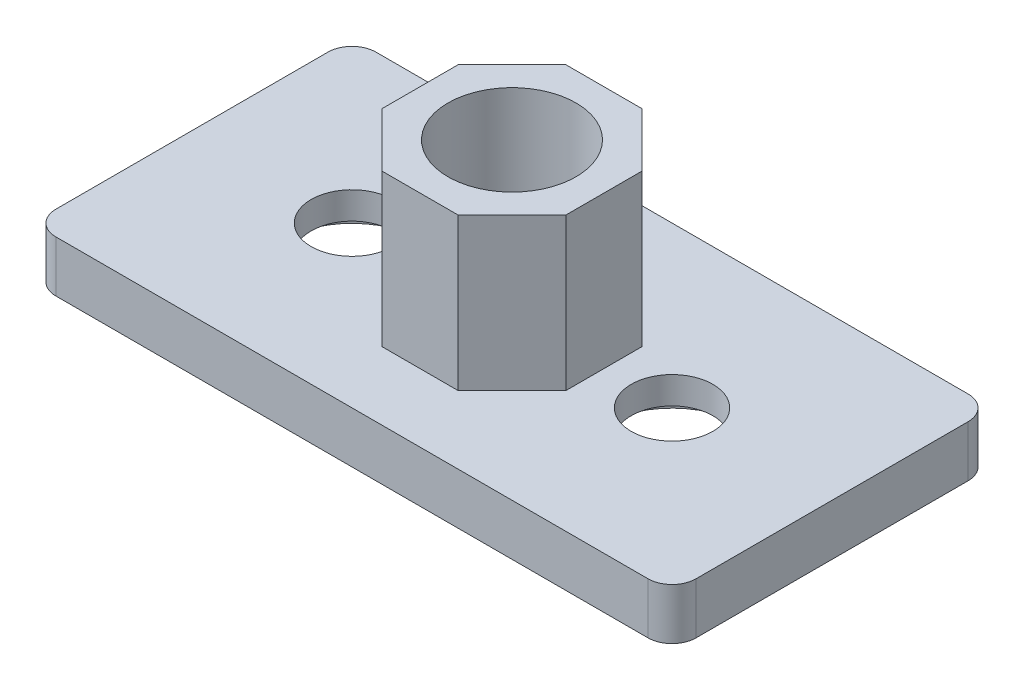
ISO-10303-21;
HEADER;
FILE_DESCRIPTION(('STEP AP214'),'2;1');
FILE_NAME('part.step','',(''),(''),'','','');
FILE_SCHEMA(('AUTOMOTIVE_DESIGN { 1 0 10303 214 1 1 1 1 }'));
ENDSEC;
DATA;
#1=APPLICATION_CONTEXT('core data for automotive mechanical design processes');
#2=APPLICATION_PROTOCOL_DEFINITION('international standard','automotive_design',2000,#1);
#3=PRODUCT_CONTEXT('',#1,'mechanical');
#4=PRODUCT('Part','Part','',(#3));
#5=PRODUCT_RELATED_PRODUCT_CATEGORY('part','',(#4));
#6=PRODUCT_DEFINITION_FORMATION('','',#4);
#7=PRODUCT_DEFINITION_CONTEXT('part definition',#1,'design');
#8=PRODUCT_DEFINITION('design','',#6,#7);
#9=PRODUCT_DEFINITION_SHAPE('','',#8);
#10=(LENGTH_UNIT() NAMED_UNIT(*) SI_UNIT(.MILLI.,.METRE.));
#11=(NAMED_UNIT(*) PLANE_ANGLE_UNIT() SI_UNIT($,.RADIAN.));
#12=(NAMED_UNIT(*) SI_UNIT($,.STERADIAN.) SOLID_ANGLE_UNIT());
#13=UNCERTAINTY_MEASURE_WITH_UNIT(LENGTH_MEASURE(1.E-05),#10,'distance_accuracy_value','');
#14=(GEOMETRIC_REPRESENTATION_CONTEXT(3) GLOBAL_UNCERTAINTY_ASSIGNED_CONTEXT((#13)) GLOBAL_UNIT_ASSIGNED_CONTEXT((#10,
#11,#12)) REPRESENTATION_CONTEXT('',''));
#15=CARTESIAN_POINT('',(0.,0.,0.));
#16=DIRECTION('',(0.,0.,1.));
#17=DIRECTION('',(1.,0.,0.));
#18=AXIS2_PLACEMENT_3D('',#15,#16,#17);
#19=CARTESIAN_POINT('',(20.,1.6,20.));
#20=DIRECTION('',(0.,-1.,0.));
#21=DIRECTION('',(1.,0.,0.));
#22=AXIS2_PLACEMENT_3D('',#19,#20,#21);
#23=PLANE('',#22);
#24=DIRECTION('',(0.,0.,-1.));
#25=VECTOR('',#24,1.);
#26=CARTESIAN_POINT('',(20.,1.6,20.));
#27=LINE('',#26,#25);
#28=CARTESIAN_POINT('',(20.,1.6,18.5));
#29=VERTEX_POINT('',#28);
#30=CARTESIAN_POINT('',(20.,1.6,1.5));
#31=VERTEX_POINT('',#30);
#32=EDGE_CURVE('E212',#29,#31,#27,.T.);
#33=ORIENTED_EDGE('',*,*,#32,.T.);
#34=CARTESIAN_POINT('',(18.5,1.6,1.5));
#35=DIRECTION('',(0.,-1.,0.));
#36=DIRECTION('',(1.,0.,0.));
#37=AXIS2_PLACEMENT_3D('',#34,#35,#36);
#38=CIRCLE('',#37,1.5);
#39=CARTESIAN_POINT('',(18.5,1.6,0.));
#40=VERTEX_POINT('',#39);
#41=EDGE_CURVE('E235',#31,#40,#38,.F.);
#42=ORIENTED_EDGE('',*,*,#41,.T.);
#43=DIRECTION('',(-1.,0.,0.));
#44=VECTOR('',#43,1.);
#45=CARTESIAN_POINT('',(20.,1.6,0.));
#46=LINE('',#45,#44);
#47=CARTESIAN_POINT('',(-18.5,1.6,0.));
#48=VERTEX_POINT('',#47);
#49=EDGE_CURVE('E202',#40,#48,#46,.T.);
#50=ORIENTED_EDGE('',*,*,#49,.T.);
#51=CARTESIAN_POINT('',(-18.5,1.6,1.5));
#52=DIRECTION('',(0.,-1.,0.));
#53=DIRECTION('',(1.,0.,0.));
#54=AXIS2_PLACEMENT_3D('',#51,#52,#53);
#55=CIRCLE('',#54,1.5);
#56=CARTESIAN_POINT('',(-20.,1.6,1.5));
#57=VERTEX_POINT('',#56);
#58=EDGE_CURVE('E231',#48,#57,#55,.F.);
#59=ORIENTED_EDGE('',*,*,#58,.T.);
#60=DIRECTION('',(0.,0.,-1.));
#61=VECTOR('',#60,1.);
#62=CARTESIAN_POINT('',(-20.,1.6,20.));
#63=LINE('',#62,#61);
#64=CARTESIAN_POINT('',(-20.,1.6,18.5));
#65=VERTEX_POINT('',#64);
#66=EDGE_CURVE('E205',#65,#57,#63,.T.);
#67=ORIENTED_EDGE('',*,*,#66,.F.);
#68=CARTESIAN_POINT('',(-18.5,1.6,18.5));
#69=DIRECTION('',(0.,-1.,0.));
#70=DIRECTION('',(1.,0.,0.));
#71=AXIS2_PLACEMENT_3D('',#68,#69,#70);
#72=CIRCLE('',#71,1.5);
#73=CARTESIAN_POINT('',(-18.5,1.6,20.));
#74=VERTEX_POINT('',#73);
#75=EDGE_CURVE('E229',#65,#74,#72,.F.);
#76=ORIENTED_EDGE('',*,*,#75,.T.);
#77=DIRECTION('',(-1.,0.,0.));
#78=VECTOR('',#77,1.);
#79=CARTESIAN_POINT('',(20.,1.6,20.));
#80=LINE('',#79,#78);
#81=CARTESIAN_POINT('',(18.5,1.6,20.));
#82=VERTEX_POINT('',#81);
#83=EDGE_CURVE('E201',#82,#74,#80,.T.);
#84=ORIENTED_EDGE('',*,*,#83,.F.);
#85=CARTESIAN_POINT('',(18.5,1.6,18.5));
#86=DIRECTION('',(0.,-1.,0.));
#87=DIRECTION('',(1.,0.,0.));
#88=AXIS2_PLACEMENT_3D('',#85,#86,#87);
#89=CIRCLE('',#88,1.5);
#90=EDGE_CURVE('E233',#82,#29,#89,.F.);
#91=ORIENTED_EDGE('',*,*,#90,.T.);
#92=EDGE_LOOP('',(#33,#42,#50,#59,#67,#76,#84,#91));
#93=FACE_BOUND('',#92,.T.);
#94=CARTESIAN_POINT('',(-10.,1.6,10.));
#95=DIRECTION('',(0.,1.,0.));
#96=DIRECTION('',(-1.,0.,0.));
#97=AXIS2_PLACEMENT_3D('',#94,#95,#96);
#98=CIRCLE('',#97,2.55);
#99=CARTESIAN_POINT('',(-12.55,1.6,10.));
#100=VERTEX_POINT('',#99);
#101=EDGE_CURVE('E194',#100,#100,#98,.T.);
#102=ORIENTED_EDGE('',*,*,#101,.F.);
#103=EDGE_LOOP('',(#102));
#104=FACE_BOUND('',#103,.T.);
#105=CARTESIAN_POINT('',(10.,1.6,10.));
#106=DIRECTION('',(0.,1.,0.));
#107=DIRECTION('',(1.,0.,0.));
#108=AXIS2_PLACEMENT_3D('',#105,#106,#107);
#109=CIRCLE('',#108,2.55);
#110=CARTESIAN_POINT('',(12.55,1.6,10.));
#111=VERTEX_POINT('',#110);
#112=EDGE_CURVE('E191',#111,#111,#109,.T.);
#113=ORIENTED_EDGE('',*,*,#112,.F.);
#114=EDGE_LOOP('',(#113));
#115=FACE_BOUND('',#114,.T.);
#116=DIRECTION('',(-1.,0.,0.));
#117=VECTOR('',#116,1.);
#118=CARTESIAN_POINT('',(2.3817279836453,1.6,4.25));
#119=LINE('',#118,#117);
#120=CARTESIAN_POINT('',(2.3817279836453,1.6,4.25));
#121=VERTEX_POINT('',#120);
#122=CARTESIAN_POINT('',(-2.3817279836453,1.6,4.25));
#123=VERTEX_POINT('',#122);
#124=EDGE_CURVE('E171',#121,#123,#119,.T.);
#125=ORIENTED_EDGE('',*,*,#124,.F.);
#126=DIRECTION('',(-0.707106781186548,0.,-0.707106781186547));
#127=VECTOR('',#126,1.);
#128=CARTESIAN_POINT('',(5.75,1.6,7.61827201635471));
#129=LINE('',#128,#127);
#130=CARTESIAN_POINT('',(5.75,1.6,7.6182720163547));
#131=VERTEX_POINT('',#130);
#132=EDGE_CURVE('E168',#131,#121,#129,.T.);
#133=ORIENTED_EDGE('',*,*,#132,.F.);
#134=DIRECTION('',(0.,0.,-1.));
#135=VECTOR('',#134,1.);
#136=CARTESIAN_POINT('',(5.75,1.6,12.3817279836453));
#137=LINE('',#136,#135);
#138=CARTESIAN_POINT('',(5.75,1.6,12.3817279836453));
#139=VERTEX_POINT('',#138);
#140=EDGE_CURVE('E536',#139,#131,#137,.T.);
#141=ORIENTED_EDGE('',*,*,#140,.F.);
#142=DIRECTION('',(0.707106781186547,0.,-0.707106781186548));
#143=VECTOR('',#142,1.);
#144=CARTESIAN_POINT('',(2.3817279836453,1.6,15.75));
#145=LINE('',#144,#143);
#146=CARTESIAN_POINT('',(2.38172798364531,1.6,15.75));
#147=VERTEX_POINT('',#146);
#148=EDGE_CURVE('E568',#147,#139,#145,.T.);
#149=ORIENTED_EDGE('',*,*,#148,.F.);
#150=DIRECTION('',(1.,0.,0.));
#151=VECTOR('',#150,1.);
#152=CARTESIAN_POINT('',(-2.38172798364529,1.6,15.75));
#153=LINE('',#152,#151);
#154=CARTESIAN_POINT('',(-2.38172798364529,1.6,15.75));
#155=VERTEX_POINT('',#154);
#156=EDGE_CURVE('E562',#155,#147,#153,.T.);
#157=ORIENTED_EDGE('',*,*,#156,.F.);
#158=DIRECTION('',(0.707106781186548,0.,0.707106781186547));
#159=VECTOR('',#158,1.);
#160=CARTESIAN_POINT('',(-5.75,1.6,12.3817279836453));
#161=LINE('',#160,#159);
#162=CARTESIAN_POINT('',(-5.74999999999999,1.6,12.3817279836453));
#163=VERTEX_POINT('',#162);
#164=EDGE_CURVE('E557',#163,#155,#161,.T.);
#165=ORIENTED_EDGE('',*,*,#164,.F.);
#166=DIRECTION('',(0.,0.,1.));
#167=VECTOR('',#166,1.);
#168=CARTESIAN_POINT('',(-5.75,1.6,7.61827201635471));
#169=LINE('',#168,#167);
#170=CARTESIAN_POINT('',(-5.75,1.6,7.61827201635471));
#171=VERTEX_POINT('',#170);
#172=EDGE_CURVE('E560',#171,#163,#169,.T.);
#173=ORIENTED_EDGE('',*,*,#172,.F.);
#174=DIRECTION('',(-0.707106781186547,0.,0.707106781186548));
#175=VECTOR('',#174,1.);
#176=CARTESIAN_POINT('',(-2.38172798364529,1.6,4.25));
#177=LINE('',#176,#175);
#178=EDGE_CURVE('E529',#123,#171,#177,.T.);
#179=ORIENTED_EDGE('',*,*,#178,.F.);
#180=EDGE_LOOP('',(#125,#133,#141,#149,#157,#165,#173,#179));
#181=FACE_BOUND('',#180,.T.);
#182=ADVANCED_FACE('F33',(#93,#104,#115,#181),#23,.F.);
#183=CARTESIAN_POINT('',(-10.,-1.60000000000001,10.));
#184=DIRECTION('',(0.,1.,0.));
#185=DIRECTION('',(-1.,0.,0.));
#186=AXIS2_PLACEMENT_3D('',#183,#184,#185);
#187=CYLINDRICAL_SURFACE('',#186,2.55);
#188=ORIENTED_EDGE('',*,*,#101,.T.);
#189=EDGE_LOOP('',(#188));
#190=FACE_BOUND('',#189,.T.);
#191=CARTESIAN_POINT('',(-10.,-0.100000000000002,10.));
#192=DIRECTION('',(0.,-1.,0.));
#193=DIRECTION('',(1.,0.,0.));
#194=AXIS2_PLACEMENT_3D('',#191,#192,#193);
#195=CIRCLE('',#194,2.55);
#196=CARTESIAN_POINT('',(-7.45,-0.100000000000001,10.));
#197=VERTEX_POINT('',#196);
#198=EDGE_CURVE('E182',#197,#197,#195,.F.);
#199=ORIENTED_EDGE('',*,*,#198,.F.);
#200=EDGE_LOOP('',(#199));
#201=FACE_BOUND('',#200,.T.);
#202=ADVANCED_FACE('F292',(#190,#201),#187,.F.);
#203=CARTESIAN_POINT('',(10.,-1.6,10.));
#204=DIRECTION('',(0.,1.,0.));
#205=DIRECTION('',(-1.,0.,0.));
#206=AXIS2_PLACEMENT_3D('',#203,#204,#205);
#207=CYLINDRICAL_SURFACE('',#206,2.55);
#208=ORIENTED_EDGE('',*,*,#112,.T.);
#209=EDGE_LOOP('',(#208));
#210=FACE_BOUND('',#209,.T.);
#211=CARTESIAN_POINT('',(10.,-0.0999999999999987,10.));
#212=DIRECTION('',(0.,-1.,0.));
#213=DIRECTION('',(1.,0.,0.));
#214=AXIS2_PLACEMENT_3D('',#211,#212,#213);
#215=CIRCLE('',#214,2.55);
#216=CARTESIAN_POINT('',(12.55,-0.0999999999999984,10.));
#217=VERTEX_POINT('',#216);
#218=EDGE_CURVE('E187',#217,#217,#215,.F.);
#219=ORIENTED_EDGE('',*,*,#218,.F.);
#220=EDGE_LOOP('',(#219));
#221=FACE_BOUND('',#220,.T.);
#222=ADVANCED_FACE('F297',(#210,#221),#207,.F.);
#223=CARTESIAN_POINT('',(-20.,-1.6,20.));
#224=DIRECTION('',(1.,0.,0.));
#225=DIRECTION('',(0.,0.,-1.));
#226=AXIS2_PLACEMENT_3D('',#223,#224,#225);
#227=PLANE('',#226);
#228=ORIENTED_EDGE('',*,*,#66,.T.);
#229=DIRECTION('',(0.,-1.,0.));
#230=VECTOR('',#229,1.);
#231=CARTESIAN_POINT('',(-20.,-1.6,1.5));
#232=LINE('',#231,#230);
#233=CARTESIAN_POINT('',(-20.,-1.6,1.5));
#234=VERTEX_POINT('',#233);
#235=EDGE_CURVE('E11',#57,#234,#232,.T.);
#236=ORIENTED_EDGE('',*,*,#235,.T.);
#237=DIRECTION('',(0.,0.,-1.));
#238=VECTOR('',#237,1.);
#239=CARTESIAN_POINT('',(-20.,-1.6,20.));
#240=LINE('',#239,#238);
#241=CARTESIAN_POINT('',(-20.,-1.6,18.5));
#242=VERTEX_POINT('',#241);
#243=EDGE_CURVE('E218',#242,#234,#240,.T.);
#244=ORIENTED_EDGE('',*,*,#243,.F.);
#245=DIRECTION('',(0.,-1.,0.));
#246=VECTOR('',#245,1.);
#247=CARTESIAN_POINT('',(-20.,1.6,18.5));
#248=LINE('',#247,#246);
#249=EDGE_CURVE('E41',#242,#65,#248,.F.);
#250=ORIENTED_EDGE('',*,*,#249,.T.);
#251=EDGE_LOOP('',(#228,#236,#244,#250));
#252=FACE_BOUND('',#251,.T.);
#253=ADVANCED_FACE('F255',(#252),#227,.F.);
#254=CARTESIAN_POINT('',(20.,-1.6,20.));
#255=DIRECTION('',(0.,1.,0.));
#256=DIRECTION('',(-1.,0.,0.));
#257=AXIS2_PLACEMENT_3D('',#254,#255,#256);
#258=PLANE('',#257);
#259=CARTESIAN_POINT('',(0.,-1.6,10.));
#260=DIRECTION('',(0.,1.,0.));
#261=DIRECTION('',(-1.,0.,0.));
#262=AXIS2_PLACEMENT_3D('',#259,#260,#261);
#263=CIRCLE('',#262,4.);
#264=CARTESIAN_POINT('',(-4.,-1.6,10.));
#265=VERTEX_POINT('',#264);
#266=EDGE_CURVE('E530',#265,#265,#263,.T.);
#267=ORIENTED_EDGE('',*,*,#266,.T.);
#268=EDGE_LOOP('',(#267));
#269=FACE_BOUND('',#268,.T.);
#270=CARTESIAN_POINT('',(-10.,-1.6,10.));
#271=DIRECTION('',(0.,-1.,0.));
#272=DIRECTION('',(1.,0.,0.));
#273=AXIS2_PLACEMENT_3D('',#270,#271,#272);
#274=CIRCLE('',#273,4.5);
#275=CARTESIAN_POINT('',(-5.5,-1.6,10.));
#276=VERTEX_POINT('',#275);
#277=EDGE_CURVE('E172',#276,#276,#274,.T.);
#278=ORIENTED_EDGE('',*,*,#277,.F.);
#279=EDGE_LOOP('',(#278));
#280=FACE_BOUND('',#279,.T.);
#281=CARTESIAN_POINT('',(10.,-1.6,10.));
#282=DIRECTION('',(0.,-1.,0.));
#283=DIRECTION('',(1.,0.,0.));
#284=AXIS2_PLACEMENT_3D('',#281,#282,#283);
#285=CIRCLE('',#284,4.5);
#286=CARTESIAN_POINT('',(14.5,-1.6,10.));
#287=VERTEX_POINT('',#286);
#288=EDGE_CURVE('E188',#287,#287,#285,.T.);
#289=ORIENTED_EDGE('',*,*,#288,.F.);
#290=EDGE_LOOP('',(#289));
#291=FACE_BOUND('',#290,.T.);
#292=DIRECTION('',(1.,0.,0.));
#293=VECTOR('',#292,1.);
#294=CARTESIAN_POINT('',(20.,-1.6,0.));
#295=LINE('',#294,#293);
#296=CARTESIAN_POINT('',(-18.5,-1.6,0.));
#297=VERTEX_POINT('',#296);
#298=CARTESIAN_POINT('',(18.5,-1.6,0.));
#299=VERTEX_POINT('',#298);
#300=EDGE_CURVE('E197',#297,#299,#295,.T.);
#301=ORIENTED_EDGE('',*,*,#300,.T.);
#302=CARTESIAN_POINT('',(18.5,-1.6,1.5));
#303=DIRECTION('',(0.,1.,0.));
#304=DIRECTION('',(-1.,0.,0.));
#305=AXIS2_PLACEMENT_3D('',#302,#303,#304);
#306=CIRCLE('',#305,1.5);
#307=CARTESIAN_POINT('',(20.,-1.6,1.5));
#308=VERTEX_POINT('',#307);
#309=EDGE_CURVE('E245',#299,#308,#306,.F.);
#310=ORIENTED_EDGE('',*,*,#309,.T.);
#311=DIRECTION('',(0.,0.,-1.));
#312=VECTOR('',#311,1.);
#313=CARTESIAN_POINT('',(20.,-1.6,20.));
#314=LINE('',#313,#312);
#315=CARTESIAN_POINT('',(20.,-1.6,18.5));
#316=VERTEX_POINT('',#315);
#317=EDGE_CURVE('E215',#316,#308,#314,.T.);
#318=ORIENTED_EDGE('',*,*,#317,.F.);
#319=CARTESIAN_POINT('',(18.5,-1.6,18.5));
#320=DIRECTION('',(0.,1.,0.));
#321=DIRECTION('',(-1.,0.,0.));
#322=AXIS2_PLACEMENT_3D('',#319,#320,#321);
#323=CIRCLE('',#322,1.5);
#324=CARTESIAN_POINT('',(18.5,-1.6,20.));
#325=VERTEX_POINT('',#324);
#326=EDGE_CURVE('E243',#316,#325,#323,.F.);
#327=ORIENTED_EDGE('',*,*,#326,.T.);
#328=DIRECTION('',(1.,0.,0.));
#329=VECTOR('',#328,1.);
#330=CARTESIAN_POINT('',(20.,-1.6,20.));
#331=LINE('',#330,#329);
#332=CARTESIAN_POINT('',(-18.5,-1.6,20.));
#333=VERTEX_POINT('',#332);
#334=EDGE_CURVE('E198',#333,#325,#331,.T.);
#335=ORIENTED_EDGE('',*,*,#334,.F.);
#336=CARTESIAN_POINT('',(-18.5,-1.6,18.5));
#337=DIRECTION('',(0.,1.,0.));
#338=DIRECTION('',(-1.,0.,0.));
#339=AXIS2_PLACEMENT_3D('',#336,#337,#338);
#340=CIRCLE('',#339,1.5);
#341=EDGE_CURVE('E55',#333,#242,#340,.F.);
#342=ORIENTED_EDGE('',*,*,#341,.T.);
#343=ORIENTED_EDGE('',*,*,#243,.T.);
#344=CARTESIAN_POINT('',(-18.5,-1.6,1.5));
#345=DIRECTION('',(0.,1.,0.));
#346=DIRECTION('',(-1.,0.,0.));
#347=AXIS2_PLACEMENT_3D('',#344,#345,#346);
#348=CIRCLE('',#347,1.5);
#349=EDGE_CURVE('E48',#234,#297,#348,.F.);
#350=ORIENTED_EDGE('',*,*,#349,.T.);
#351=EDGE_LOOP('',(#301,#310,#318,#327,#335,#342,#343,#350));
#352=FACE_BOUND('',#351,.T.);
#353=ADVANCED_FACE('F266',(#269,#280,#291,#352),#258,.F.);
#354=CARTESIAN_POINT('',(20.,-1.6,20.));
#355=DIRECTION('',(-1.,0.,0.));
#356=DIRECTION('',(0.,0.,1.));
#357=AXIS2_PLACEMENT_3D('',#354,#355,#356);
#358=PLANE('',#357);
#359=ORIENTED_EDGE('',*,*,#317,.T.);
#360=DIRECTION('',(0.,1.,0.));
#361=VECTOR('',#360,1.);
#362=CARTESIAN_POINT('',(20.,-1.6,1.5));
#363=LINE('',#362,#361);
#364=EDGE_CURVE('E226',#308,#31,#363,.T.);
#365=ORIENTED_EDGE('',*,*,#364,.T.);
#366=ORIENTED_EDGE('',*,*,#32,.F.);
#367=DIRECTION('',(0.,1.,0.));
#368=VECTOR('',#367,1.);
#369=CARTESIAN_POINT('',(20.,-1.6,18.5));
#370=LINE('',#369,#368);
#371=EDGE_CURVE('E220',#29,#316,#370,.F.);
#372=ORIENTED_EDGE('',*,*,#371,.T.);
#373=EDGE_LOOP('',(#359,#365,#366,#372));
#374=FACE_BOUND('',#373,.T.);
#375=ADVANCED_FACE('F274',(#374),#358,.F.);
#376=CARTESIAN_POINT('',(0.,0.,20.));
#377=DIRECTION('',(0.,0.,1.));
#378=DIRECTION('',(1.,0.,0.));
#379=AXIS2_PLACEMENT_3D('',#376,#377,#378);
#380=PLANE('',#379);
#381=ORIENTED_EDGE('',*,*,#334,.T.);
#382=DIRECTION('',(0.,1.,0.));
#383=VECTOR('',#382,1.);
#384=CARTESIAN_POINT('',(18.5,1.6,20.));
#385=LINE('',#384,#383);
#386=EDGE_CURVE('E250',#325,#82,#385,.T.);
#387=ORIENTED_EDGE('',*,*,#386,.T.);
#388=ORIENTED_EDGE('',*,*,#83,.T.);
#389=DIRECTION('',(0.,-1.,0.));
#390=VECTOR('',#389,1.);
#391=CARTESIAN_POINT('',(-18.5,-1.6,20.));
#392=LINE('',#391,#390);
#393=EDGE_CURVE('E247',#74,#333,#392,.T.);
#394=ORIENTED_EDGE('',*,*,#393,.T.);
#395=EDGE_LOOP('',(#381,#387,#388,#394));
#396=FACE_BOUND('',#395,.T.);
#397=ADVANCED_FACE('F264',(#396),#380,.T.);
#398=CARTESIAN_POINT('',(0.,0.,0.));
#399=DIRECTION('',(0.,0.,1.));
#400=DIRECTION('',(1.,0.,0.));
#401=AXIS2_PLACEMENT_3D('',#398,#399,#400);
#402=PLANE('',#401);
#403=ORIENTED_EDGE('',*,*,#49,.F.);
#404=DIRECTION('',(0.,1.,0.));
#405=VECTOR('',#404,1.);
#406=CARTESIAN_POINT('',(18.5,0.,0.));
#407=LINE('',#406,#405);
#408=EDGE_CURVE('E239',#40,#299,#407,.F.);
#409=ORIENTED_EDGE('',*,*,#408,.T.);
#410=ORIENTED_EDGE('',*,*,#300,.F.);
#411=DIRECTION('',(0.,-1.,0.));
#412=VECTOR('',#411,1.);
#413=CARTESIAN_POINT('',(-18.5,0.,0.));
#414=LINE('',#413,#412);
#415=EDGE_CURVE('E237',#297,#48,#414,.F.);
#416=ORIENTED_EDGE('',*,*,#415,.T.);
#417=EDGE_LOOP('',(#403,#409,#410,#416));
#418=FACE_BOUND('',#417,.T.);
#419=ADVANCED_FACE('F282',(#418),#402,.F.);
#420=CARTESIAN_POINT('',(10.,-0.0999999999999987,10.));
#421=DIRECTION('',(0.,-1.,0.));
#422=DIRECTION('',(1.,0.,0.));
#423=AXIS2_PLACEMENT_3D('',#420,#421,#422);
#424=PLANE('',#423);
#425=CARTESIAN_POINT('',(10.,-0.0999999999999987,10.));
#426=DIRECTION('',(0.,-1.,0.));
#427=DIRECTION('',(1.,0.,0.));
#428=AXIS2_PLACEMENT_3D('',#425,#426,#427);
#429=CIRCLE('',#428,4.5);
#430=CARTESIAN_POINT('',(14.5,-0.099999999999998,10.));
#431=VERTEX_POINT('',#430);
#432=EDGE_CURVE('E184',#431,#431,#429,.T.);
#433=ORIENTED_EDGE('',*,*,#432,.T.);
#434=EDGE_LOOP('',(#433));
#435=FACE_BOUND('',#434,.T.);
#436=ORIENTED_EDGE('',*,*,#218,.T.);
#437=EDGE_LOOP('',(#436));
#438=FACE_BOUND('',#437,.T.);
#439=ADVANCED_FACE('F362',(#435,#438),#424,.T.);
#440=CARTESIAN_POINT('',(10.,-0.0999999999999987,10.));
#441=DIRECTION('',(0.,-1.,0.));
#442=DIRECTION('',(1.,0.,0.));
#443=AXIS2_PLACEMENT_3D('',#440,#441,#442);
#444=CYLINDRICAL_SURFACE('',#443,4.5);
#445=ORIENTED_EDGE('',*,*,#432,.F.);
#446=EDGE_LOOP('',(#445));
#447=FACE_BOUND('',#446,.T.);
#448=ORIENTED_EDGE('',*,*,#288,.T.);
#449=EDGE_LOOP('',(#448));
#450=FACE_BOUND('',#449,.T.);
#451=ADVANCED_FACE('F357',(#447,#450),#444,.F.);
#452=CARTESIAN_POINT('',(-10.,-0.100000000000002,10.));
#453=DIRECTION('',(0.,-1.,0.));
#454=DIRECTION('',(1.,0.,0.));
#455=AXIS2_PLACEMENT_3D('',#452,#453,#454);
#456=PLANE('',#455);
#457=CARTESIAN_POINT('',(-10.,-0.100000000000002,10.));
#458=DIRECTION('',(0.,-1.,0.));
#459=DIRECTION('',(1.,0.,0.));
#460=AXIS2_PLACEMENT_3D('',#457,#458,#459);
#461=CIRCLE('',#460,4.5);
#462=CARTESIAN_POINT('',(-5.5,-0.100000000000001,10.));
#463=VERTEX_POINT('',#462);
#464=EDGE_CURVE('E175',#463,#463,#461,.T.);
#465=ORIENTED_EDGE('',*,*,#464,.T.);
#466=EDGE_LOOP('',(#465));
#467=FACE_BOUND('',#466,.T.);
#468=ORIENTED_EDGE('',*,*,#198,.T.);
#469=EDGE_LOOP('',(#468));
#470=FACE_BOUND('',#469,.T.);
#471=ADVANCED_FACE('F354',(#467,#470),#456,.T.);
#472=CARTESIAN_POINT('',(-10.,-0.100000000000002,10.));
#473=DIRECTION('',(0.,-1.,0.));
#474=DIRECTION('',(1.,0.,0.));
#475=AXIS2_PLACEMENT_3D('',#472,#473,#474);
#476=CYLINDRICAL_SURFACE('',#475,4.5);
#477=ORIENTED_EDGE('',*,*,#464,.F.);
#478=EDGE_LOOP('',(#477));
#479=FACE_BOUND('',#478,.T.);
#480=ORIENTED_EDGE('',*,*,#277,.T.);
#481=EDGE_LOOP('',(#480));
#482=FACE_BOUND('',#481,.T.);
#483=ADVANCED_FACE('F353',(#479,#482),#476,.F.);
#484=CARTESIAN_POINT('',(2.3817279836453,11.1,4.25));
#485=DIRECTION('',(0.,0.,1.));
#486=DIRECTION('',(1.,0.,0.));
#487=AXIS2_PLACEMENT_3D('',#484,#485,#486);
#488=PLANE('',#487);
#489=ORIENTED_EDGE('',*,*,#124,.T.);
#490=DIRECTION('',(0.,-1.,0.));
#491=VECTOR('',#490,1.);
#492=CARTESIAN_POINT('',(-2.3817279836453,11.1,4.25));
#493=LINE('',#492,#491);
#494=CARTESIAN_POINT('',(-2.3817279836453,11.1,4.25));
#495=VERTEX_POINT('',#494);
#496=EDGE_CURVE('E152',#495,#123,#493,.T.);
#497=ORIENTED_EDGE('',*,*,#496,.F.);
#498=DIRECTION('',(-1.,0.,0.));
#499=VECTOR('',#498,1.);
#500=CARTESIAN_POINT('',(2.3817279836453,11.1,4.25));
#501=LINE('',#500,#499);
#502=CARTESIAN_POINT('',(2.3817279836453,11.1,4.25));
#503=VERTEX_POINT('',#502);
#504=EDGE_CURVE('E159',#503,#495,#501,.T.);
#505=ORIENTED_EDGE('',*,*,#504,.F.);
#506=DIRECTION('',(0.,-1.,0.));
#507=VECTOR('',#506,1.);
#508=CARTESIAN_POINT('',(2.3817279836453,11.1,4.25));
#509=LINE('',#508,#507);
#510=EDGE_CURVE('E533',#503,#121,#509,.T.);
#511=ORIENTED_EDGE('',*,*,#510,.T.);
#512=EDGE_LOOP('',(#489,#497,#505,#511));
#513=FACE_BOUND('',#512,.T.);
#514=ADVANCED_FACE('F170',(#513),#488,.F.);
#515=CARTESIAN_POINT('',(-2.3817279836453,11.1,4.25));
#516=DIRECTION('',(0.707106781186548,0.,0.707106781186547));
#517=DIRECTION('',(0.707106781186547,0.,-0.707106781186548));
#518=AXIS2_PLACEMENT_3D('',#515,#516,#517);
#519=PLANE('',#518);
#520=ORIENTED_EDGE('',*,*,#178,.T.);
#521=DIRECTION('',(0.,-1.,0.));
#522=VECTOR('',#521,1.);
#523=CARTESIAN_POINT('',(-5.75,11.1,7.61827201635471));
#524=LINE('',#523,#522);
#525=CARTESIAN_POINT('',(-5.75,11.1,7.61827201635471));
#526=VERTEX_POINT('',#525);
#527=EDGE_CURVE('E155',#526,#171,#524,.T.);
#528=ORIENTED_EDGE('',*,*,#527,.F.);
#529=DIRECTION('',(-0.707106781186547,0.,0.707106781186548));
#530=VECTOR('',#529,1.);
#531=CARTESIAN_POINT('',(-2.3817279836453,11.1,4.25));
#532=LINE('',#531,#530);
#533=EDGE_CURVE('E147',#495,#526,#532,.T.);
#534=ORIENTED_EDGE('',*,*,#533,.F.);
#535=ORIENTED_EDGE('',*,*,#496,.T.);
#536=EDGE_LOOP('',(#520,#528,#534,#535));
#537=FACE_BOUND('',#536,.T.);
#538=ADVANCED_FACE('F150',(#537),#519,.F.);
#539=CARTESIAN_POINT('',(-5.75,11.1,7.61827201635471));
#540=DIRECTION('',(1.,0.,0.));
#541=DIRECTION('',(0.,0.,-1.));
#542=AXIS2_PLACEMENT_3D('',#539,#540,#541);
#543=PLANE('',#542);
#544=ORIENTED_EDGE('',*,*,#172,.T.);
#545=DIRECTION('',(0.,-1.,0.));
#546=VECTOR('',#545,1.);
#547=CARTESIAN_POINT('',(-5.75,11.1,12.3817279836453));
#548=LINE('',#547,#546);
#549=CARTESIAN_POINT('',(-5.75,11.1,12.3817279836453));
#550=VERTEX_POINT('',#549);
#551=EDGE_CURVE('E177',#550,#163,#548,.T.);
#552=ORIENTED_EDGE('',*,*,#551,.F.);
#553=DIRECTION('',(0.,0.,1.));
#554=VECTOR('',#553,1.);
#555=CARTESIAN_POINT('',(-5.75,11.1,7.61827201635471));
#556=LINE('',#555,#554);
#557=EDGE_CURVE('E158',#526,#550,#556,.T.);
#558=ORIENTED_EDGE('',*,*,#557,.F.);
#559=ORIENTED_EDGE('',*,*,#527,.T.);
#560=EDGE_LOOP('',(#544,#552,#558,#559));
#561=FACE_BOUND('',#560,.T.);
#562=ADVANCED_FACE('F344',(#561),#543,.F.);
#563=CARTESIAN_POINT('',(-5.75,11.1,12.3817279836453));
#564=DIRECTION('',(0.707106781186547,0.,-0.707106781186548));
#565=DIRECTION('',(-0.707106781186548,0.,-0.707106781186547));
#566=AXIS2_PLACEMENT_3D('',#563,#564,#565);
#567=PLANE('',#566);
#568=ORIENTED_EDGE('',*,*,#164,.T.);
#569=DIRECTION('',(0.,-1.,0.));
#570=VECTOR('',#569,1.);
#571=CARTESIAN_POINT('',(-2.38172798364529,11.1,15.75));
#572=LINE('',#571,#570);
#573=CARTESIAN_POINT('',(-2.38172798364529,11.1,15.75));
#574=VERTEX_POINT('',#573);
#575=EDGE_CURVE('E550',#574,#155,#572,.T.);
#576=ORIENTED_EDGE('',*,*,#575,.F.);
#577=DIRECTION('',(0.707106781186548,0.,0.707106781186547));
#578=VECTOR('',#577,1.);
#579=CARTESIAN_POINT('',(-5.75,11.1,12.3817279836453));
#580=LINE('',#579,#578);
#581=EDGE_CURVE('E558',#550,#574,#580,.T.);
#582=ORIENTED_EDGE('',*,*,#581,.F.);
#583=ORIENTED_EDGE('',*,*,#551,.T.);
#584=EDGE_LOOP('',(#568,#576,#582,#583));
#585=FACE_BOUND('',#584,.T.);
#586=ADVANCED_FACE('F340',(#585),#567,.F.);
#587=CARTESIAN_POINT('',(-2.38172798364529,11.1,15.75));
#588=DIRECTION('',(0.,0.,-1.));
#589=DIRECTION('',(-1.,0.,0.));
#590=AXIS2_PLACEMENT_3D('',#587,#588,#589);
#591=PLANE('',#590);
#592=ORIENTED_EDGE('',*,*,#156,.T.);
#593=DIRECTION('',(0.,-1.,0.));
#594=VECTOR('',#593,1.);
#595=CARTESIAN_POINT('',(2.3817279836453,11.1,15.75));
#596=LINE('',#595,#594);
#597=CARTESIAN_POINT('',(2.3817279836453,11.1,15.75));
#598=VERTEX_POINT('',#597);
#599=EDGE_CURVE('E547',#598,#147,#596,.T.);
#600=ORIENTED_EDGE('',*,*,#599,.F.);
#601=DIRECTION('',(1.,0.,0.));
#602=VECTOR('',#601,1.);
#603=CARTESIAN_POINT('',(-2.38172798364529,11.1,15.75));
#604=LINE('',#603,#602);
#605=EDGE_CURVE('E576',#574,#598,#604,.T.);
#606=ORIENTED_EDGE('',*,*,#605,.F.);
#607=ORIENTED_EDGE('',*,*,#575,.T.);
#608=EDGE_LOOP('',(#592,#600,#606,#607));
#609=FACE_BOUND('',#608,.T.);
#610=ADVANCED_FACE('F336',(#609),#591,.F.);
#611=CARTESIAN_POINT('',(2.3817279836453,11.1,15.75));
#612=DIRECTION('',(-0.707106781186548,0.,-0.707106781186547));
#613=DIRECTION('',(-0.707106781186547,0.,0.707106781186548));
#614=AXIS2_PLACEMENT_3D('',#611,#612,#613);
#615=PLANE('',#614);
#616=ORIENTED_EDGE('',*,*,#148,.T.);
#617=DIRECTION('',(0.,-1.,0.));
#618=VECTOR('',#617,1.);
#619=CARTESIAN_POINT('',(5.75,11.1,12.3817279836453));
#620=LINE('',#619,#618);
#621=CARTESIAN_POINT('',(5.75,11.1,12.3817279836453));
#622=VERTEX_POINT('',#621);
#623=EDGE_CURVE('E539',#622,#139,#620,.T.);
#624=ORIENTED_EDGE('',*,*,#623,.F.);
#625=DIRECTION('',(0.707106781186547,0.,-0.707106781186548));
#626=VECTOR('',#625,1.);
#627=CARTESIAN_POINT('',(2.3817279836453,11.1,15.75));
#628=LINE('',#627,#626);
#629=EDGE_CURVE('E574',#598,#622,#628,.T.);
#630=ORIENTED_EDGE('',*,*,#629,.F.);
#631=ORIENTED_EDGE('',*,*,#599,.T.);
#632=EDGE_LOOP('',(#616,#624,#630,#631));
#633=FACE_BOUND('',#632,.T.);
#634=ADVANCED_FACE('F332',(#633),#615,.F.);
#635=CARTESIAN_POINT('',(5.75,11.1,12.3817279836453));
#636=DIRECTION('',(-1.,0.,0.));
#637=DIRECTION('',(0.,0.,1.));
#638=AXIS2_PLACEMENT_3D('',#635,#636,#637);
#639=PLANE('',#638);
#640=ORIENTED_EDGE('',*,*,#140,.T.);
#641=DIRECTION('',(0.,-1.,0.));
#642=VECTOR('',#641,1.);
#643=CARTESIAN_POINT('',(5.75,11.1,7.61827201635471));
#644=LINE('',#643,#642);
#645=CARTESIAN_POINT('',(5.75,11.1,7.61827201635471));
#646=VERTEX_POINT('',#645);
#647=EDGE_CURVE('E535',#646,#131,#644,.T.);
#648=ORIENTED_EDGE('',*,*,#647,.F.);
#649=DIRECTION('',(0.,0.,-1.));
#650=VECTOR('',#649,1.);
#651=CARTESIAN_POINT('',(5.75,11.1,12.3817279836453));
#652=LINE('',#651,#650);
#653=EDGE_CURVE('E541',#622,#646,#652,.T.);
#654=ORIENTED_EDGE('',*,*,#653,.F.);
#655=ORIENTED_EDGE('',*,*,#623,.T.);
#656=EDGE_LOOP('',(#640,#648,#654,#655));
#657=FACE_BOUND('',#656,.T.);
#658=ADVANCED_FACE('F328',(#657),#639,.F.);
#659=CARTESIAN_POINT('',(5.75,11.1,7.61827201635471));
#660=DIRECTION('',(-0.707106781186548,0.,0.707106781186548));
#661=DIRECTION('',(0.707106781186548,0.,0.707106781186547));
#662=AXIS2_PLACEMENT_3D('',#659,#660,#661);
#663=PLANE('',#662);
#664=ORIENTED_EDGE('',*,*,#132,.T.);
#665=ORIENTED_EDGE('',*,*,#510,.F.);
#666=DIRECTION('',(-0.707106781186548,0.,-0.707106781186547));
#667=VECTOR('',#666,1.);
#668=CARTESIAN_POINT('',(5.75,11.1,7.61827201635471));
#669=LINE('',#668,#667);
#670=EDGE_CURVE('E164',#646,#503,#669,.T.);
#671=ORIENTED_EDGE('',*,*,#670,.F.);
#672=ORIENTED_EDGE('',*,*,#647,.T.);
#673=EDGE_LOOP('',(#664,#665,#671,#672));
#674=FACE_BOUND('',#673,.T.);
#675=ADVANCED_FACE('F320',(#674),#663,.F.);
#676=CARTESIAN_POINT('',(0.,11.1,0.));
#677=DIRECTION('',(0.,1.,0.));
#678=DIRECTION('',(-1.,0.,0.));
#679=AXIS2_PLACEMENT_3D('',#676,#677,#678);
#680=PLANE('',#679);
#681=CARTESIAN_POINT('',(0.,11.1,10.));
#682=DIRECTION('',(0.,1.,0.));
#683=DIRECTION('',(-1.,0.,0.));
#684=AXIS2_PLACEMENT_3D('',#681,#682,#683);
#685=CIRCLE('',#684,4.);
#686=CARTESIAN_POINT('',(-4.,11.1,10.));
#687=VERTEX_POINT('',#686);
#688=EDGE_CURVE('E583',#687,#687,#685,.T.);
#689=ORIENTED_EDGE('',*,*,#688,.F.);
#690=EDGE_LOOP('',(#689));
#691=FACE_BOUND('',#690,.T.);
#692=ORIENTED_EDGE('',*,*,#504,.T.);
#693=ORIENTED_EDGE('',*,*,#533,.T.);
#694=ORIENTED_EDGE('',*,*,#557,.T.);
#695=ORIENTED_EDGE('',*,*,#581,.T.);
#696=ORIENTED_EDGE('',*,*,#605,.T.);
#697=ORIENTED_EDGE('',*,*,#629,.T.);
#698=ORIENTED_EDGE('',*,*,#653,.T.);
#699=ORIENTED_EDGE('',*,*,#670,.T.);
#700=EDGE_LOOP('',(#692,#693,#694,#695,#696,#697,#698,#699));
#701=FACE_BOUND('',#700,.T.);
#702=ADVANCED_FACE('F162',(#691,#701),#680,.T.);
#703=CARTESIAN_POINT('',(0.,-1.6,10.));
#704=DIRECTION('',(0.,1.,0.));
#705=DIRECTION('',(-1.,0.,0.));
#706=AXIS2_PLACEMENT_3D('',#703,#704,#705);
#707=CYLINDRICAL_SURFACE('',#706,4.);
#708=ORIENTED_EDGE('',*,*,#266,.F.);
#709=EDGE_LOOP('',(#708));
#710=FACE_BOUND('',#709,.T.);
#711=ORIENTED_EDGE('',*,*,#688,.T.);
#712=EDGE_LOOP('',(#711));
#713=FACE_BOUND('',#712,.T.);
#714=ADVANCED_FACE('F311',(#710,#713),#707,.F.);
#715=CARTESIAN_POINT('',(18.5,-1.6,1.5));
#716=DIRECTION('',(0.,1.,0.));
#717=DIRECTION('',(0.,0.,1.));
#718=AXIS2_PLACEMENT_3D('',#715,#716,#717);
#719=CYLINDRICAL_SURFACE('',#718,1.5);
#720=ORIENTED_EDGE('',*,*,#309,.F.);
#721=ORIENTED_EDGE('',*,*,#408,.F.);
#722=ORIENTED_EDGE('',*,*,#41,.F.);
#723=ORIENTED_EDGE('',*,*,#364,.F.);
#724=EDGE_LOOP('',(#720,#721,#722,#723));
#725=FACE_BOUND('',#724,.T.);
#726=ADVANCED_FACE('F278',(#725),#719,.T.);
#727=CARTESIAN_POINT('',(18.5,0.,18.5));
#728=DIRECTION('',(0.,-1.,0.));
#729=DIRECTION('',(0.,0.,-1.));
#730=AXIS2_PLACEMENT_3D('',#727,#728,#729);
#731=CYLINDRICAL_SURFACE('',#730,1.5);
#732=ORIENTED_EDGE('',*,*,#326,.F.);
#733=ORIENTED_EDGE('',*,*,#371,.F.);
#734=ORIENTED_EDGE('',*,*,#90,.F.);
#735=ORIENTED_EDGE('',*,*,#386,.F.);
#736=EDGE_LOOP('',(#732,#733,#734,#735));
#737=FACE_BOUND('',#736,.T.);
#738=ADVANCED_FACE('F271',(#737),#731,.T.);
#739=CARTESIAN_POINT('',(-18.5,-1.6,1.5));
#740=DIRECTION('',(0.,-1.,0.));
#741=DIRECTION('',(0.,0.,-1.));
#742=AXIS2_PLACEMENT_3D('',#739,#740,#741);
#743=CYLINDRICAL_SURFACE('',#742,1.5);
#744=ORIENTED_EDGE('',*,*,#58,.F.);
#745=ORIENTED_EDGE('',*,*,#415,.F.);
#746=ORIENTED_EDGE('',*,*,#349,.F.);
#747=ORIENTED_EDGE('',*,*,#235,.F.);
#748=EDGE_LOOP('',(#744,#745,#746,#747));
#749=FACE_BOUND('',#748,.T.);
#750=ADVANCED_FACE('F284',(#749),#743,.T.);
#751=CARTESIAN_POINT('',(-18.5,0.,18.5));
#752=DIRECTION('',(0.,1.,0.));
#753=DIRECTION('',(0.,0.,1.));
#754=AXIS2_PLACEMENT_3D('',#751,#752,#753);
#755=CYLINDRICAL_SURFACE('',#754,1.5);
#756=ORIENTED_EDGE('',*,*,#75,.F.);
#757=ORIENTED_EDGE('',*,*,#249,.F.);
#758=ORIENTED_EDGE('',*,*,#341,.F.);
#759=ORIENTED_EDGE('',*,*,#393,.F.);
#760=EDGE_LOOP('',(#756,#757,#758,#759));
#761=FACE_BOUND('',#760,.T.);
#762=ADVANCED_FACE('F35',(#761),#755,.T.);
#763=CLOSED_SHELL('',(#182,#202,#222,#253,#353,#375,#397,#419,#439,#451,#471,#483,#514,#538,
#562,#586,#610,#634,#658,#675,#702,#714,#726,#738,#750,#762));
#764=MANIFOLD_SOLID_BREP('B2',#763);
#765=ADVANCED_BREP_SHAPE_REPRESENTATION('',(#18,#764),#14);
#766=SHAPE_DEFINITION_REPRESENTATION(#9,#765);
ENDSEC;
END-ISO-10303-21;
